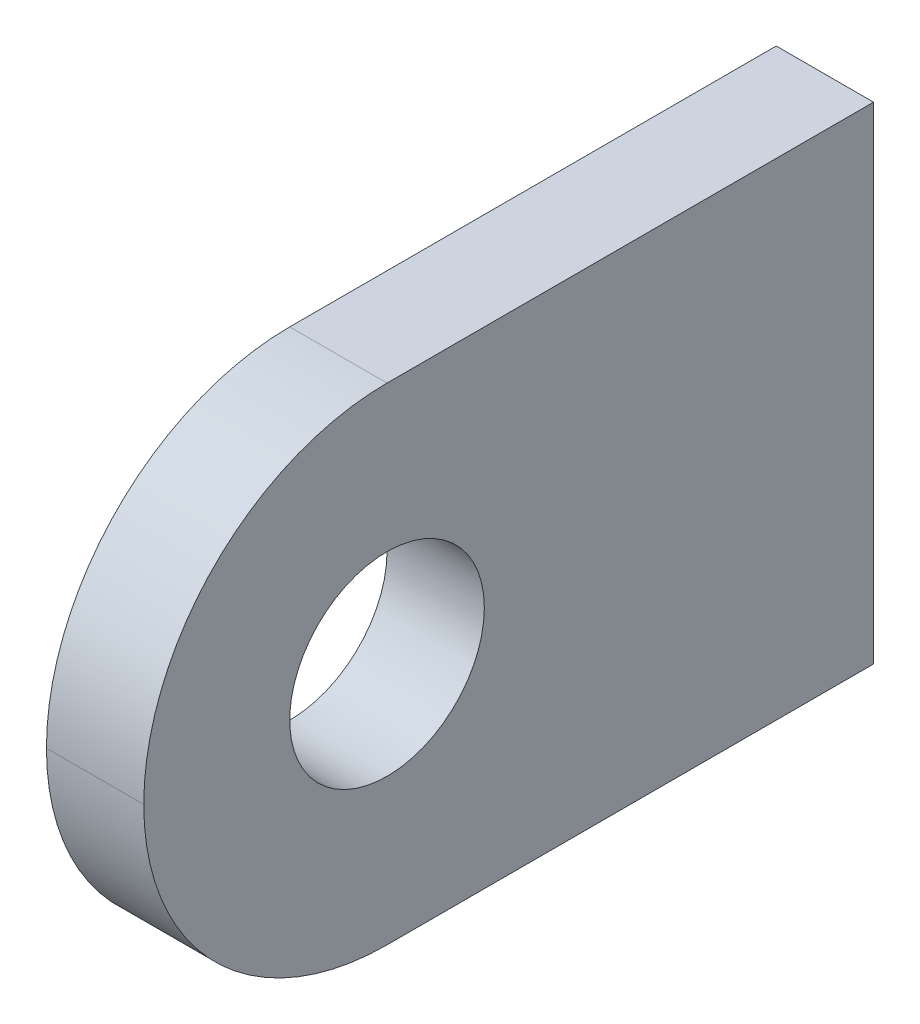
ISO-10303-21;
HEADER;
FILE_DESCRIPTION(('STEP AP214'),'2;1');
FILE_NAME('part.step','',(''),(''),'','','');
FILE_SCHEMA(('AUTOMOTIVE_DESIGN { 1 0 10303 214 1 1 1 1 }'));
ENDSEC;
DATA;
#1=APPLICATION_CONTEXT('core data for automotive mechanical design processes');
#2=APPLICATION_PROTOCOL_DEFINITION('international standard','automotive_design',2000,#1);
#3=PRODUCT_CONTEXT('',#1,'mechanical');
#4=PRODUCT('Part','Part','',(#3));
#5=PRODUCT_RELATED_PRODUCT_CATEGORY('part','',(#4));
#6=PRODUCT_DEFINITION_FORMATION('','',#4);
#7=PRODUCT_DEFINITION_CONTEXT('part definition',#1,'design');
#8=PRODUCT_DEFINITION('design','',#6,#7);
#9=PRODUCT_DEFINITION_SHAPE('','',#8);
#10=(LENGTH_UNIT() NAMED_UNIT(*) SI_UNIT(.MILLI.,.METRE.));
#11=(NAMED_UNIT(*) PLANE_ANGLE_UNIT() SI_UNIT($,.RADIAN.));
#12=(NAMED_UNIT(*) SI_UNIT($,.STERADIAN.) SOLID_ANGLE_UNIT());
#13=UNCERTAINTY_MEASURE_WITH_UNIT(LENGTH_MEASURE(1.E-05),#10,'distance_accuracy_value','');
#14=(GEOMETRIC_REPRESENTATION_CONTEXT(3) GLOBAL_UNCERTAINTY_ASSIGNED_CONTEXT((#13)) GLOBAL_UNIT_ASSIGNED_CONTEXT((#10,
#11,#12)) REPRESENTATION_CONTEXT('',''));
#15=CARTESIAN_POINT('',(0.,0.,0.));
#16=DIRECTION('',(0.,0.,1.));
#17=DIRECTION('',(1.,0.,0.));
#18=AXIS2_PLACEMENT_3D('',#15,#16,#17);
#19=CARTESIAN_POINT('',(170.,-74.,20.));
#20=DIRECTION('',(1.,0.,0.));
#21=DIRECTION('',(0.,0.,-1.));
#22=AXIS2_PLACEMENT_3D('',#19,#20,#21);
#23=CYLINDRICAL_SURFACE('',#22,10.);
#24=DIRECTION('',(1.,0.,0.));
#25=VECTOR('',#24,1.);
#26=CARTESIAN_POINT('',(170.,-74.,30.));
#27=LINE('',#26,#25);
#28=CARTESIAN_POINT('',(166.,-74.,30.));
#29=VERTEX_POINT('',#28);
#30=CARTESIAN_POINT('',(170.,-74.,30.));
#31=VERTEX_POINT('',#30);
#32=EDGE_CURVE('E11',#29,#31,#27,.T.);
#33=ORIENTED_EDGE('',*,*,#32,.F.);
#34=CARTESIAN_POINT('',(166.,-74.,20.));
#35=DIRECTION('',(1.,0.,0.));
#36=DIRECTION('',(0.,0.,-1.));
#37=AXIS2_PLACEMENT_3D('',#34,#35,#36);
#38=CIRCLE('',#37,10.);
#39=CARTESIAN_POINT('',(166.,-84.,20.));
#40=VERTEX_POINT('',#39);
#41=EDGE_CURVE('E95',#29,#40,#38,.T.);
#42=ORIENTED_EDGE('',*,*,#41,.T.);
#43=DIRECTION('',(1.,0.,0.));
#44=VECTOR('',#43,1.);
#45=CARTESIAN_POINT('',(170.,-84.,20.));
#46=LINE('',#45,#44);
#47=CARTESIAN_POINT('',(170.,-84.,20.));
#48=VERTEX_POINT('',#47);
#49=EDGE_CURVE('E47',#40,#48,#46,.T.);
#50=ORIENTED_EDGE('',*,*,#49,.T.);
#51=CARTESIAN_POINT('',(170.,-74.,20.));
#52=DIRECTION('',(1.,0.,0.));
#53=DIRECTION('',(0.,0.,-1.));
#54=AXIS2_PLACEMENT_3D('',#51,#52,#53);
#55=CIRCLE('',#54,10.);
#56=EDGE_CURVE('E117',#31,#48,#55,.T.);
#57=ORIENTED_EDGE('',*,*,#56,.F.);
#58=EDGE_LOOP('',(#33,#42,#50,#57));
#59=FACE_BOUND('',#58,.T.);
#60=ADVANCED_FACE('F37',(#59),#23,.T.);
#61=CARTESIAN_POINT('',(170.,-84.,0.));
#62=DIRECTION('',(0.,-1.,0.));
#63=DIRECTION('',(0.,0.,-1.));
#64=AXIS2_PLACEMENT_3D('',#61,#62,#63);
#65=PLANE('',#64);
#66=ORIENTED_EDGE('',*,*,#49,.F.);
#67=DIRECTION('',(0.,0.,-1.));
#68=VECTOR('',#67,1.);
#69=CARTESIAN_POINT('',(166.,-84.,0.));
#70=LINE('',#69,#68);
#71=CARTESIAN_POINT('',(166.,-84.,0.));
#72=VERTEX_POINT('',#71);
#73=EDGE_CURVE('E107',#40,#72,#70,.T.);
#74=ORIENTED_EDGE('',*,*,#73,.T.);
#75=DIRECTION('',(1.,0.,0.));
#76=VECTOR('',#75,1.);
#77=CARTESIAN_POINT('',(170.,-84.,0.));
#78=LINE('',#77,#76);
#79=CARTESIAN_POINT('',(170.,-84.,0.));
#80=VERTEX_POINT('',#79);
#81=EDGE_CURVE('E112',#72,#80,#78,.T.);
#82=ORIENTED_EDGE('',*,*,#81,.T.);
#83=DIRECTION('',(0.,0.,-1.));
#84=VECTOR('',#83,1.);
#85=CARTESIAN_POINT('',(170.,-84.,0.));
#86=LINE('',#85,#84);
#87=EDGE_CURVE('E124',#48,#80,#86,.T.);
#88=ORIENTED_EDGE('',*,*,#87,.F.);
#89=EDGE_LOOP('',(#66,#74,#82,#88));
#90=FACE_BOUND('',#89,.T.);
#91=ADVANCED_FACE('F126',(#90),#65,.T.);
#92=CARTESIAN_POINT('',(170.,-84.,0.));
#93=DIRECTION('',(0.,0.,-1.));
#94=DIRECTION('',(0.,1.,0.));
#95=AXIS2_PLACEMENT_3D('',#92,#93,#94);
#96=PLANE('',#95);
#97=ORIENTED_EDGE('',*,*,#81,.F.);
#98=DIRECTION('',(0.,1.,0.));
#99=VECTOR('',#98,1.);
#100=CARTESIAN_POINT('',(166.,0.,0.));
#101=LINE('',#100,#99);
#102=CARTESIAN_POINT('',(166.,-64.,0.));
#103=VERTEX_POINT('',#102);
#104=EDGE_CURVE('E104',#72,#103,#101,.T.);
#105=ORIENTED_EDGE('',*,*,#104,.T.);
#106=DIRECTION('',(1.,0.,0.));
#107=VECTOR('',#106,1.);
#108=CARTESIAN_POINT('',(170.,-64.,0.));
#109=LINE('',#108,#107);
#110=CARTESIAN_POINT('',(170.,-64.,0.));
#111=VERTEX_POINT('',#110);
#112=EDGE_CURVE('E55',#103,#111,#109,.T.);
#113=ORIENTED_EDGE('',*,*,#112,.T.);
#114=DIRECTION('',(0.,1.,0.));
#115=VECTOR('',#114,1.);
#116=CARTESIAN_POINT('',(170.,-84.,0.));
#117=LINE('',#116,#115);
#118=EDGE_CURVE('E88',#80,#111,#117,.T.);
#119=ORIENTED_EDGE('',*,*,#118,.F.);
#120=EDGE_LOOP('',(#97,#105,#113,#119));
#121=FACE_BOUND('',#120,.T.);
#122=ADVANCED_FACE('F154',(#121),#96,.T.);
#123=CARTESIAN_POINT('',(170.,-64.,0.));
#124=DIRECTION('',(0.,1.,0.));
#125=DIRECTION('',(0.,0.,1.));
#126=AXIS2_PLACEMENT_3D('',#123,#124,#125);
#127=PLANE('',#126);
#128=ORIENTED_EDGE('',*,*,#112,.F.);
#129=DIRECTION('',(0.,0.,-1.));
#130=VECTOR('',#129,1.);
#131=CARTESIAN_POINT('',(166.,-64.,0.));
#132=LINE('',#131,#130);
#133=CARTESIAN_POINT('',(166.,-64.,20.));
#134=VERTEX_POINT('',#133);
#135=EDGE_CURVE('E93',#103,#134,#132,.F.);
#136=ORIENTED_EDGE('',*,*,#135,.T.);
#137=DIRECTION('',(1.,0.,0.));
#138=VECTOR('',#137,1.);
#139=CARTESIAN_POINT('',(170.,-64.,20.));
#140=LINE('',#139,#138);
#141=CARTESIAN_POINT('',(170.,-64.,20.));
#142=VERTEX_POINT('',#141);
#143=EDGE_CURVE('E41',#134,#142,#140,.T.);
#144=ORIENTED_EDGE('',*,*,#143,.T.);
#145=DIRECTION('',(0.,0.,1.));
#146=VECTOR('',#145,1.);
#147=CARTESIAN_POINT('',(170.,-64.,0.));
#148=LINE('',#147,#146);
#149=EDGE_CURVE('E130',#111,#142,#148,.T.);
#150=ORIENTED_EDGE('',*,*,#149,.F.);
#151=EDGE_LOOP('',(#128,#136,#144,#150));
#152=FACE_BOUND('',#151,.T.);
#153=ADVANCED_FACE('F97',(#152),#127,.T.);
#154=CARTESIAN_POINT('',(170.,-74.,20.));
#155=DIRECTION('',(1.,0.,0.));
#156=DIRECTION('',(0.,0.,-1.));
#157=AXIS2_PLACEMENT_3D('',#154,#155,#156);
#158=CYLINDRICAL_SURFACE('',#157,3.99999999999999);
#159=CARTESIAN_POINT('',(170.,-74.,20.));
#160=DIRECTION('',(1.,0.,0.));
#161=DIRECTION('',(0.,0.,-1.));
#162=AXIS2_PLACEMENT_3D('',#159,#160,#161);
#163=CIRCLE('',#162,3.99999999999999);
#164=CARTESIAN_POINT('',(170.,-74.,16.));
#165=VERTEX_POINT('',#164);
#166=EDGE_CURVE('E106',#165,#165,#163,.T.);
#167=ORIENTED_EDGE('',*,*,#166,.T.);
#168=EDGE_LOOP('',(#167));
#169=FACE_BOUND('',#168,.T.);
#170=CARTESIAN_POINT('',(166.,-74.,20.));
#171=DIRECTION('',(1.,0.,0.));
#172=DIRECTION('',(0.,0.,-1.));
#173=AXIS2_PLACEMENT_3D('',#170,#171,#172);
#174=CIRCLE('',#173,3.99999999999999);
#175=CARTESIAN_POINT('',(166.,-74.,16.));
#176=VERTEX_POINT('',#175);
#177=EDGE_CURVE('E98',#176,#176,#174,.T.);
#178=ORIENTED_EDGE('',*,*,#177,.F.);
#179=EDGE_LOOP('',(#178));
#180=FACE_BOUND('',#179,.T.);
#181=ADVANCED_FACE('F135',(#169,#180),#158,.F.);
#182=CARTESIAN_POINT('',(170.,-74.,20.));
#183=DIRECTION('',(1.,0.,0.));
#184=DIRECTION('',(0.,0.,-1.));
#185=AXIS2_PLACEMENT_3D('',#182,#183,#184);
#186=CYLINDRICAL_SURFACE('',#185,10.);
#187=CARTESIAN_POINT('',(166.,-74.,20.));
#188=DIRECTION('',(1.,0.,0.));
#189=DIRECTION('',(0.,0.,-1.));
#190=AXIS2_PLACEMENT_3D('',#187,#188,#189);
#191=CIRCLE('',#190,10.);
#192=EDGE_CURVE('E82',#134,#29,#191,.T.);
#193=ORIENTED_EDGE('',*,*,#192,.T.);
#194=ORIENTED_EDGE('',*,*,#32,.T.);
#195=CARTESIAN_POINT('',(170.,-74.,20.));
#196=DIRECTION('',(1.,0.,0.));
#197=DIRECTION('',(0.,0.,-1.));
#198=AXIS2_PLACEMENT_3D('',#195,#196,#197);
#199=CIRCLE('',#198,10.);
#200=EDGE_CURVE('E84',#142,#31,#199,.T.);
#201=ORIENTED_EDGE('',*,*,#200,.F.);
#202=ORIENTED_EDGE('',*,*,#143,.F.);
#203=EDGE_LOOP('',(#193,#194,#201,#202));
#204=FACE_BOUND('',#203,.T.);
#205=ADVANCED_FACE('F39',(#204),#186,.T.);
#206=CARTESIAN_POINT('',(170.,0.,0.));
#207=DIRECTION('',(1.,0.,0.));
#208=DIRECTION('',(0.,0.,-1.));
#209=AXIS2_PLACEMENT_3D('',#206,#207,#208);
#210=PLANE('',#209);
#211=ORIENTED_EDGE('',*,*,#166,.F.);
#212=EDGE_LOOP('',(#211));
#213=FACE_BOUND('',#212,.T.);
#214=ORIENTED_EDGE('',*,*,#149,.T.);
#215=ORIENTED_EDGE('',*,*,#200,.T.);
#216=ORIENTED_EDGE('',*,*,#56,.T.);
#217=ORIENTED_EDGE('',*,*,#87,.T.);
#218=ORIENTED_EDGE('',*,*,#118,.T.);
#219=EDGE_LOOP('',(#214,#215,#216,#217,#218));
#220=FACE_BOUND('',#219,.T.);
#221=ADVANCED_FACE('F122',(#213,#220),#210,.T.);
#222=CARTESIAN_POINT('',(166.,0.,0.));
#223=DIRECTION('',(1.,0.,0.));
#224=DIRECTION('',(0.,0.,-1.));
#225=AXIS2_PLACEMENT_3D('',#222,#223,#224);
#226=PLANE('',#225);
#227=ORIENTED_EDGE('',*,*,#177,.T.);
#228=EDGE_LOOP('',(#227));
#229=FACE_BOUND('',#228,.T.);
#230=ORIENTED_EDGE('',*,*,#135,.F.);
#231=ORIENTED_EDGE('',*,*,#104,.F.);
#232=ORIENTED_EDGE('',*,*,#73,.F.);
#233=ORIENTED_EDGE('',*,*,#41,.F.);
#234=ORIENTED_EDGE('',*,*,#192,.F.);
#235=EDGE_LOOP('',(#230,#231,#232,#233,#234));
#236=FACE_BOUND('',#235,.T.);
#237=ADVANCED_FACE('F91',(#229,#236),#226,.F.);
#238=CLOSED_SHELL('',(#60,#91,#122,#153,#181,#205,#221,#237));
#239=MANIFOLD_SOLID_BREP('B2',#238);
#240=ADVANCED_BREP_SHAPE_REPRESENTATION('',(#18,#239),#14);
#241=SHAPE_DEFINITION_REPRESENTATION(#9,#240);
ENDSEC;
END-ISO-10303-21;
